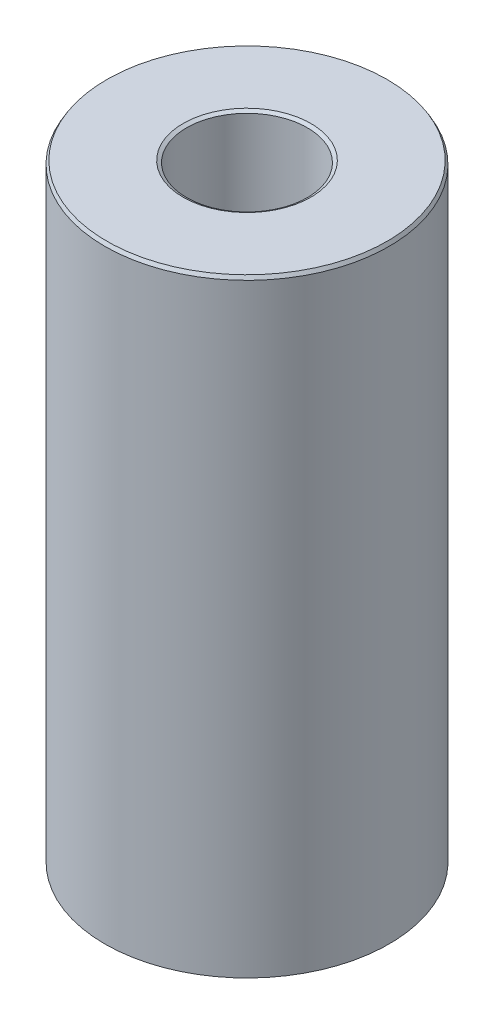
ISO-10303-21;
HEADER;
FILE_DESCRIPTION(('STEP AP214'),'2;1');
FILE_NAME('part.step','',(''),(''),'','','');
FILE_SCHEMA(('AUTOMOTIVE_DESIGN { 1 0 10303 214 1 1 1 1 }'));
ENDSEC;
DATA;
#1=APPLICATION_CONTEXT('core data for automotive mechanical design processes');
#2=APPLICATION_PROTOCOL_DEFINITION('international standard','automotive_design',2000,#1);
#3=PRODUCT_CONTEXT('',#1,'mechanical');
#4=PRODUCT('Part','Part','',(#3));
#5=PRODUCT_RELATED_PRODUCT_CATEGORY('part','',(#4));
#6=PRODUCT_DEFINITION_FORMATION('','',#4);
#7=PRODUCT_DEFINITION_CONTEXT('part definition',#1,'design');
#8=PRODUCT_DEFINITION('design','',#6,#7);
#9=PRODUCT_DEFINITION_SHAPE('','',#8);
#10=(LENGTH_UNIT() NAMED_UNIT(*) SI_UNIT(.MILLI.,.METRE.));
#11=(NAMED_UNIT(*) PLANE_ANGLE_UNIT() SI_UNIT($,.RADIAN.));
#12=(NAMED_UNIT(*) SI_UNIT($,.STERADIAN.) SOLID_ANGLE_UNIT());
#13=UNCERTAINTY_MEASURE_WITH_UNIT(LENGTH_MEASURE(1.E-05),#10,'distance_accuracy_value','');
#14=(GEOMETRIC_REPRESENTATION_CONTEXT(3) GLOBAL_UNCERTAINTY_ASSIGNED_CONTEXT((#13)) GLOBAL_UNIT_ASSIGNED_CONTEXT((#10,
#11,#12)) REPRESENTATION_CONTEXT('',''));
#15=CARTESIAN_POINT('',(0.,0.,0.));
#16=DIRECTION('',(0.,0.,1.));
#17=DIRECTION('',(1.,0.,0.));
#18=AXIS2_PLACEMENT_3D('',#15,#16,#17);
#19=CARTESIAN_POINT('',(0.,139.398280249267,0.));
#20=DIRECTION('',(0.,-1.,0.));
#21=DIRECTION('',(0.,0.,-1.));
#22=AXIS2_PLACEMENT_3D('',#19,#20,#21);
#23=CYLINDRICAL_SURFACE('',#22,32.5);
#24=CARTESIAN_POINT('',(0.,0.454807925108797,0.));
#25=DIRECTION('',(0.,1.,0.));
#26=DIRECTION('',(0.,0.,1.));
#27=AXIS2_PLACEMENT_3D('',#24,#25,#26);
#28=CIRCLE('',#27,32.5);
#29=CARTESIAN_POINT('',(0.,0.454807925108797,32.5));
#30=VERTEX_POINT('',#29);
#31=EDGE_CURVE('E10',#30,#30,#28,.T.);
#32=ORIENTED_EDGE('',*,*,#31,.T.);
#33=EDGE_LOOP('',(#32));
#34=FACE_BOUND('',#33,.T.);
#35=CARTESIAN_POINT('',(0.,138.610529815293,0.));
#36=DIRECTION('',(0.,1.,0.));
#37=DIRECTION('',(0.,0.,1.));
#38=AXIS2_PLACEMENT_3D('',#35,#36,#37);
#39=CIRCLE('',#38,32.5);
#40=CARTESIAN_POINT('',(0.,138.610529815293,-32.5));
#41=VERTEX_POINT('',#40);
#42=EDGE_CURVE('E50',#41,#41,#39,.F.);
#43=ORIENTED_EDGE('',*,*,#42,.T.);
#44=EDGE_LOOP('',(#43));
#45=FACE_BOUND('',#44,.T.);
#46=ADVANCED_FACE('F39',(#34,#45),#23,.T.);
#47=CARTESIAN_POINT('',(0.,139.398280249267,0.));
#48=DIRECTION('',(0.,1.,0.));
#49=DIRECTION('',(0.,0.,1.));
#50=AXIS2_PLACEMENT_3D('',#47,#48,#49);
#51=PLANE('',#50);
#52=CARTESIAN_POINT('',(0.,139.398280249267,0.));
#53=DIRECTION('',(0.,1.,0.));
#54=DIRECTION('',(0.,0.,1.));
#55=AXIS2_PLACEMENT_3D('',#52,#53,#54);
#56=CIRCLE('',#55,14.614351416814);
#57=CARTESIAN_POINT('',(0.,139.398280249267,14.614351416814));
#58=VERTEX_POINT('',#57);
#59=EDGE_CURVE('E58',#58,#58,#56,.F.);
#60=ORIENTED_EDGE('',*,*,#59,.T.);
#61=EDGE_LOOP('',(#60));
#62=FACE_BOUND('',#61,.T.);
#63=CARTESIAN_POINT('',(0.,139.398280249267,0.));
#64=DIRECTION('',(0.,1.,0.));
#65=DIRECTION('',(0.,0.,1.));
#66=AXIS2_PLACEMENT_3D('',#63,#64,#65);
#67=CIRCLE('',#66,32.0451920748912);
#68=CARTESIAN_POINT('',(0.,139.398280249267,-32.0451920748912));
#69=VERTEX_POINT('',#68);
#70=EDGE_CURVE('E61',#69,#69,#67,.T.);
#71=ORIENTED_EDGE('',*,*,#70,.T.);
#72=EDGE_LOOP('',(#71));
#73=FACE_BOUND('',#72,.T.);
#74=ADVANCED_FACE('F88',(#62,#73),#51,.T.);
#75=CARTESIAN_POINT('',(0.,0.,0.));
#76=DIRECTION('',(0.,1.,0.));
#77=DIRECTION('',(0.,0.,1.));
#78=AXIS2_PLACEMENT_3D('',#75,#76,#77);
#79=PLANE('',#78);
#80=CARTESIAN_POINT('',(0.,0.,0.));
#81=DIRECTION('',(0.,1.,0.));
#82=DIRECTION('',(0.,0.,1.));
#83=AXIS2_PLACEMENT_3D('',#80,#81,#82);
#84=CIRCLE('',#83,14.2814089079494);
#85=CARTESIAN_POINT('',(0.,0.,14.2814089079494));
#86=VERTEX_POINT('',#85);
#87=EDGE_CURVE('E51',#86,#86,#84,.T.);
#88=ORIENTED_EDGE('',*,*,#87,.T.);
#89=EDGE_LOOP('',(#88));
#90=FACE_BOUND('',#89,.T.);
#91=CARTESIAN_POINT('',(0.,0.,0.));
#92=DIRECTION('',(0.,1.,0.));
#93=DIRECTION('',(0.,0.,1.));
#94=AXIS2_PLACEMENT_3D('',#91,#92,#93);
#95=CIRCLE('',#94,31.7122495660266);
#96=CARTESIAN_POINT('',(0.,0.,31.7122495660266));
#97=VERTEX_POINT('',#96);
#98=EDGE_CURVE('E54',#97,#97,#95,.F.);
#99=ORIENTED_EDGE('',*,*,#98,.T.);
#100=EDGE_LOOP('',(#99));
#101=FACE_BOUND('',#100,.T.);
#102=ADVANCED_FACE('F83',(#90,#101),#79,.F.);
#103=CARTESIAN_POINT('',(0.,139.398280249267,0.));
#104=DIRECTION('',(0.,-1.,0.));
#105=DIRECTION('',(0.,0.,-1.));
#106=AXIS2_PLACEMENT_3D('',#103,#104,#105);
#107=CYLINDRICAL_SURFACE('',#106,13.8266009828406);
#108=CARTESIAN_POINT('',(0.,138.943472324158,0.));
#109=DIRECTION('',(0.,1.,0.));
#110=DIRECTION('',(0.,0.,1.));
#111=AXIS2_PLACEMENT_3D('',#108,#109,#110);
#112=CIRCLE('',#111,13.8266009828406);
#113=CARTESIAN_POINT('',(0.,138.943472324158,13.8266009828406));
#114=VERTEX_POINT('',#113);
#115=EDGE_CURVE('E67',#114,#114,#112,.T.);
#116=ORIENTED_EDGE('',*,*,#115,.T.);
#117=EDGE_LOOP('',(#116));
#118=FACE_BOUND('',#117,.T.);
#119=CARTESIAN_POINT('',(0.,0.787750433973472,0.));
#120=DIRECTION('',(0.,1.,0.));
#121=DIRECTION('',(0.,0.,1.));
#122=AXIS2_PLACEMENT_3D('',#119,#120,#121);
#123=CIRCLE('',#122,13.8266009828406);
#124=CARTESIAN_POINT('',(0.,0.787750433973472,13.8266009828406));
#125=VERTEX_POINT('',#124);
#126=EDGE_CURVE('E69',#125,#125,#123,.F.);
#127=ORIENTED_EDGE('',*,*,#126,.T.);
#128=EDGE_LOOP('',(#127));
#129=FACE_BOUND('',#128,.T.);
#130=ADVANCED_FACE('F71',(#118,#129),#107,.F.);
#131=CARTESIAN_POINT('',(0.,138.943472324158,0.));
#132=DIRECTION('',(0.,1.,0.));
#133=DIRECTION('',(0.,0.,1.));
#134=AXIS2_PLACEMENT_3D('',#131,#132,#133);
#135=CONICAL_SURFACE('',#134,13.8266009828406,1.0471975511966);
#136=ORIENTED_EDGE('',*,*,#59,.F.);
#137=EDGE_LOOP('',(#136));
#138=FACE_BOUND('',#137,.T.);
#139=ORIENTED_EDGE('',*,*,#115,.F.);
#140=EDGE_LOOP('',(#139));
#141=FACE_BOUND('',#140,.T.);
#142=ADVANCED_FACE('F77',(#138,#141),#135,.F.);
#143=CARTESIAN_POINT('',(0.,0.,0.));
#144=DIRECTION('',(0.,-1.,0.));
#145=DIRECTION('',(0.,0.,-1.));
#146=AXIS2_PLACEMENT_3D('',#143,#144,#145);
#147=CONICAL_SURFACE('',#146,14.2814089079494,0.523598775598288);
#148=ORIENTED_EDGE('',*,*,#126,.F.);
#149=EDGE_LOOP('',(#148));
#150=FACE_BOUND('',#149,.T.);
#151=ORIENTED_EDGE('',*,*,#87,.F.);
#152=EDGE_LOOP('',(#151));
#153=FACE_BOUND('',#152,.T.);
#154=ADVANCED_FACE('F73',(#150,#153),#147,.F.);
#155=CARTESIAN_POINT('',(0.,0.454807925108797,0.));
#156=DIRECTION('',(0.,1.,0.));
#157=DIRECTION('',(0.,0.,1.));
#158=AXIS2_PLACEMENT_3D('',#155,#156,#157);
#159=CONICAL_SURFACE('',#158,32.5,1.04719755119661);
#160=ORIENTED_EDGE('',*,*,#98,.F.);
#161=EDGE_LOOP('',(#160));
#162=FACE_BOUND('',#161,.T.);
#163=ORIENTED_EDGE('',*,*,#31,.F.);
#164=EDGE_LOOP('',(#163));
#165=FACE_BOUND('',#164,.T.);
#166=ADVANCED_FACE('F76',(#162,#165),#159,.T.);
#167=CARTESIAN_POINT('',(0.,139.398280249267,0.));
#168=DIRECTION('',(0.,-1.,0.));
#169=DIRECTION('',(0.,0.,-1.));
#170=AXIS2_PLACEMENT_3D('',#167,#168,#169);
#171=CONICAL_SURFACE('',#170,32.0451920748912,0.523598775598293);
#172=CARTESIAN_POINT('',(0.,138.610529815293,-32.5));
#173=CARTESIAN_POINT('',(0.,138.618735548981,-32.4952624174468));
#174=CARTESIAN_POINT('',(0.,138.626941282668,-32.4905248348936));
#175=CARTESIAN_POINT('',(0.,138.643352750042,-32.4810496697871));
#176=CARTESIAN_POINT('',(0.,138.651558483729,-32.4763120872339));
#177=CARTESIAN_POINT('',(0.,138.667969951104,-32.4668369221275));
#178=CARTESIAN_POINT('',(0.,138.676175684791,-32.4620993395743));
#179=CARTESIAN_POINT('',(0.,138.692587152166,-32.4526241744678));
#180=CARTESIAN_POINT('',(0.,138.700792885853,-32.4478865919146));
#181=CARTESIAN_POINT('',(0.,138.717204353227,-32.4384114268082));
#182=CARTESIAN_POINT('',(0.,138.725410086914,-32.433673844255));
#183=CARTESIAN_POINT('',(0.,138.741821554289,-32.4241986791485));
#184=CARTESIAN_POINT('',(0.,138.750027287976,-32.4194610965953));
#185=CARTESIAN_POINT('',(0.,138.766438755351,-32.4099859314889));
#186=CARTESIAN_POINT('',(0.,138.774644489038,-32.4052483489357));
#187=CARTESIAN_POINT('',(0.,138.791055956412,-32.3957731838292));
#188=CARTESIAN_POINT('',(0.,138.799261690099,-32.391035601276));
#189=CARTESIAN_POINT('',(0.,138.815673157474,-32.3815604361696));
#190=CARTESIAN_POINT('',(0.,138.823878891161,-32.3768228536164));
#191=CARTESIAN_POINT('',(0.,138.840290358536,-32.3673476885099));
#192=CARTESIAN_POINT('',(0.,138.848496092223,-32.3626101059567));
#193=CARTESIAN_POINT('',(0.,138.864907559597,-32.3531349408503));
#194=CARTESIAN_POINT('',(0.,138.873113293284,-32.3483973582971));
#195=CARTESIAN_POINT('',(0.,138.889524760659,-32.3389221931906));
#196=CARTESIAN_POINT('',(0.,138.897730494346,-32.3341846106374));
#197=CARTESIAN_POINT('',(0.,138.914141961721,-32.324709445531));
#198=CARTESIAN_POINT('',(0.,138.922347695408,-32.3199718629778));
#199=CARTESIAN_POINT('',(0.,138.938759162782,-32.3104966978713));
#200=CARTESIAN_POINT('',(0.,138.94696489647,-32.3057591153181));
#201=CARTESIAN_POINT('',(0.,138.963376363844,-32.2962839502117));
#202=CARTESIAN_POINT('',(0.,138.971582097531,-32.2915463676585));
#203=CARTESIAN_POINT('',(0.,138.987993564906,-32.282071202552));
#204=CARTESIAN_POINT('',(0.,138.996199298593,-32.2773336199988));
#205=CARTESIAN_POINT('',(0.,139.012610765967,-32.2678584548924));
#206=CARTESIAN_POINT('',(0.,139.020816499655,-32.2631208723392));
#207=CARTESIAN_POINT('',(0.,139.037227967029,-32.2536457072327));
#208=CARTESIAN_POINT('',(0.,139.045433700716,-32.2489081246795));
#209=CARTESIAN_POINT('',(0.,139.061845168091,-32.2394329595731));
#210=CARTESIAN_POINT('',(0.,139.070050901778,-32.2346953770199));
#211=CARTESIAN_POINT('',(0.,139.086462369152,-32.2252202119134));
#212=CARTESIAN_POINT('',(0.,139.09466810284,-32.2204826293602));
#213=CARTESIAN_POINT('',(0.,139.111079570214,-32.2110074642538));
#214=CARTESIAN_POINT('',(0.,139.119285303901,-32.2062698817006));
#215=CARTESIAN_POINT('',(0.,139.135696771276,-32.1967947165941));
#216=CARTESIAN_POINT('',(0.,139.143902504963,-32.1920571340409));
#217=CARTESIAN_POINT('',(0.,139.160313972337,-32.1825819689345));
#218=CARTESIAN_POINT('',(0.,139.168519706025,-32.1778443863813));
#219=CARTESIAN_POINT('',(0.,139.184931173399,-32.1683692212748));
#220=CARTESIAN_POINT('',(0.,139.193136907086,-32.1636316387216));
#221=CARTESIAN_POINT('',(0.,139.209548374461,-32.1541564736152));
#222=CARTESIAN_POINT('',(0.,139.217754108148,-32.1494188910619));
#223=CARTESIAN_POINT('',(0.,139.234165575522,-32.1399437259555));
#224=CARTESIAN_POINT('',(0.,139.24237130921,-32.1352061434023));
#225=CARTESIAN_POINT('',(0.,139.258782776584,-32.1257309782959));
#226=CARTESIAN_POINT('',(0.,139.266988510271,-32.1209933957426));
#227=CARTESIAN_POINT('',(0.,139.283399977646,-32.1115182306362));
#228=CARTESIAN_POINT('',(0.,139.291605711333,-32.106780648083));
#229=CARTESIAN_POINT('',(0.,139.308017178707,-32.0973054829766));
#230=CARTESIAN_POINT('',(0.,139.316222912395,-32.0925679004233));
#231=CARTESIAN_POINT('',(0.,139.332634379769,-32.0830927353169));
#232=CARTESIAN_POINT('',(0.,139.340840113456,-32.0783551527637));
#233=CARTESIAN_POINT('',(0.,139.357251580831,-32.0688799876573));
#234=CARTESIAN_POINT('',(0.,139.365457314518,-32.064142405104));
#235=CARTESIAN_POINT('',(0.,139.381868781892,-32.0546672399976));
#236=CARTESIAN_POINT('',(0.,139.39007451558,-32.0499296574444));
#237=CARTESIAN_POINT('',(0.,139.398280249267,-32.0451920748912));
#238=B_SPLINE_CURVE_WITH_KNOTS('',3,(#172,#173,#174,#175,#176,#177,#178,#179,#180,#181,#182,
#183,#184,#185,#186,#187,#188,#189,#190,#191,#192,#193,#194,#195,#196,#197,#198,#199,#200,#201,
#202,#203,#204,#205,#206,#207,#208,#209,#210,#211,#212,#213,#214,#215,#216,#217,#218,#219,#220,
#221,#222,#223,#224,#225,#226,#227,#228,#229,#230,#231,#232,#233,#234,#235,#236,#237),
.UNSPECIFIED.,.F.,.F.,(4,2,2,2,2,2,2,2,2,2,2,2,2,2,2,2,2,2,2,2,2,2,2,2,2,2,2,2,2,2,2,2,4),(0.,
0.0284254953193016,0.0568509906386032,0.0852764859579083,0.11370198127721,0.142127476596511,
0.170552971915817,0.198978467235118,0.22740396255442,0.255829457873725,0.284254953193026,
0.312680448512328,0.341105943831633,0.369531439150935,0.397956934470236,0.426382429789541,
0.454807925108843,0.483233420428144,0.511658915747446,0.540084411066751,0.568509906386053,
0.596935401705354,0.625360897024659,0.653786392343961,0.682211887663263,0.710637382982568,
0.739062878301869,0.767488373621171,0.795913868940476,0.824339364259778,0.852764859579079,
0.881190354898385,0.909615850217686),.UNSPECIFIED.);
#239=EDGE_CURVE('BSEAM45',#41,#69,#238,.T.);
#240=ORIENTED_EDGE('',*,*,#42,.F.);
#241=ORIENTED_EDGE('',*,*,#70,.F.);
#242=ORIENTED_EDGE('',*,*,#239,.T.);
#243=ORIENTED_EDGE('',*,*,#239,.F.);
#244=EDGE_LOOP('',(#240,#242,#241,#243));
#245=FACE_BOUND('',#244,.T.);
#246=ADVANCED_FACE('F45',(#245),#171,.T.);
#247=CLOSED_SHELL('',(#46,#74,#102,#130,#142,#154,#166,#246));
#248=MANIFOLD_SOLID_BREP('B2',#247);
#249=ADVANCED_BREP_SHAPE_REPRESENTATION('',(#18,#248),#14);
#250=SHAPE_DEFINITION_REPRESENTATION(#9,#249);
ENDSEC;
END-ISO-10303-21;
